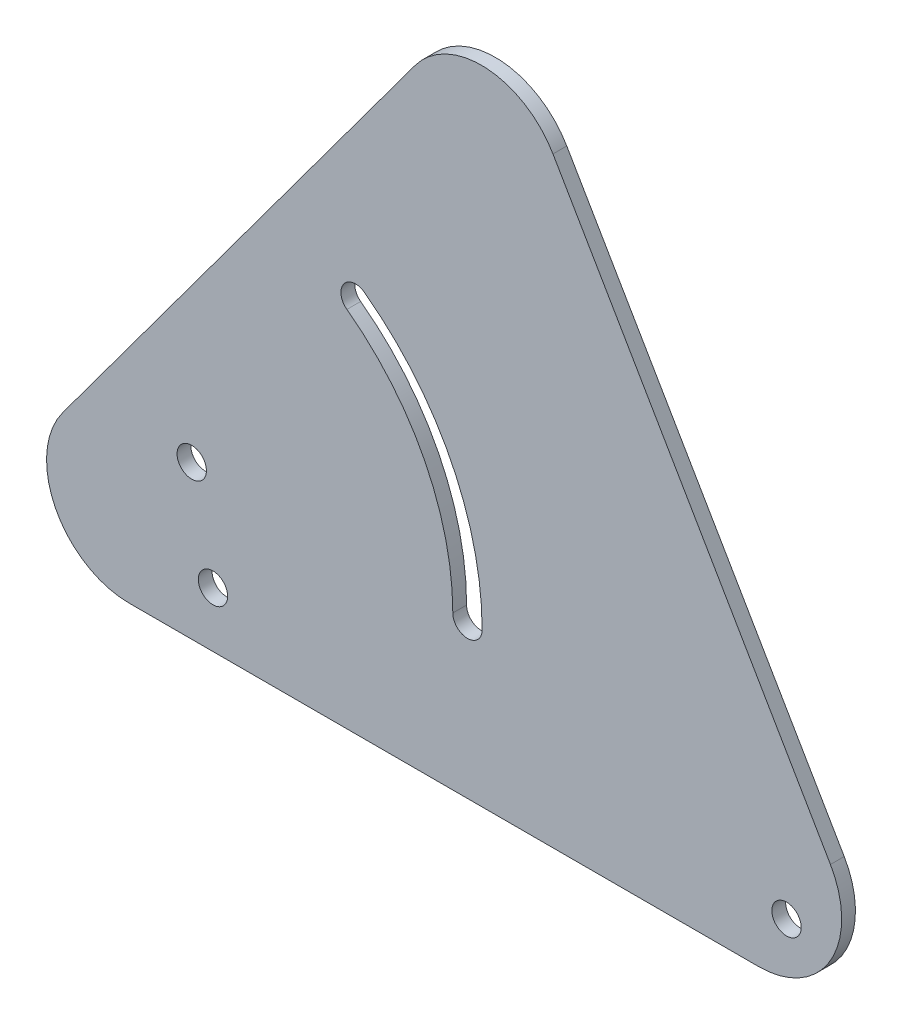
ISO-10303-21;
HEADER;
FILE_DESCRIPTION(('STEP AP214'),'2;1');
FILE_NAME('part.step','',(''),(''),'','','');
FILE_SCHEMA(('AUTOMOTIVE_DESIGN { 1 0 10303 214 1 1 1 1 }'));
ENDSEC;
DATA;
#1=APPLICATION_CONTEXT('core data for automotive mechanical design processes');
#2=APPLICATION_PROTOCOL_DEFINITION('international standard','automotive_design',2000,#1);
#3=PRODUCT_CONTEXT('',#1,'mechanical');
#4=PRODUCT('Part','Part','',(#3));
#5=PRODUCT_RELATED_PRODUCT_CATEGORY('part','',(#4));
#6=PRODUCT_DEFINITION_FORMATION('','',#4);
#7=PRODUCT_DEFINITION_CONTEXT('part definition',#1,'design');
#8=PRODUCT_DEFINITION('design','',#6,#7);
#9=PRODUCT_DEFINITION_SHAPE('','',#8);
#10=(LENGTH_UNIT() NAMED_UNIT(*) SI_UNIT(.MILLI.,.METRE.));
#11=(NAMED_UNIT(*) PLANE_ANGLE_UNIT() SI_UNIT($,.RADIAN.));
#12=(NAMED_UNIT(*) SI_UNIT($,.STERADIAN.) SOLID_ANGLE_UNIT());
#13=UNCERTAINTY_MEASURE_WITH_UNIT(LENGTH_MEASURE(1.E-05),#10,'distance_accuracy_value','');
#14=(GEOMETRIC_REPRESENTATION_CONTEXT(3) GLOBAL_UNCERTAINTY_ASSIGNED_CONTEXT((#13)) GLOBAL_UNIT_ASSIGNED_CONTEXT((#10,
#11,#12)) REPRESENTATION_CONTEXT('',''));
#15=CARTESIAN_POINT('',(0.,0.,0.));
#16=DIRECTION('',(0.,0.,1.));
#17=DIRECTION('',(1.,0.,0.));
#18=AXIS2_PLACEMENT_3D('',#15,#16,#17);
#19=CARTESIAN_POINT('',(37.7646327076216,19.05,-3.175));
#20=DIRECTION('',(0.,0.,1.));
#21=DIRECTION('',(1.,0.,0.));
#22=AXIS2_PLACEMENT_3D('',#19,#20,#21);
#23=CYLINDRICAL_SURFACE('',#22,19.05);
#24=CARTESIAN_POINT('',(37.7646327076216,19.05,0.));
#25=DIRECTION('',(0.,0.,1.));
#26=DIRECTION('',(-1.,0.,0.));
#27=AXIS2_PLACEMENT_3D('',#24,#25,#26);
#28=CIRCLE('',#27,19.05);
#29=CARTESIAN_POINT('',(22.4439580026019,30.3716353316545,0.));
#30=VERTEX_POINT('',#29);
#31=CARTESIAN_POINT('',(37.7646327076216,0.,0.));
#32=VERTEX_POINT('',#31);
#33=EDGE_CURVE('E171',#30,#32,#28,.T.);
#34=ORIENTED_EDGE('',*,*,#33,.F.);
#35=DIRECTION('',(0.,0.,1.));
#36=VECTOR('',#35,1.);
#37=CARTESIAN_POINT('',(22.4439580026019,30.3716353316545,-3.175));
#38=LINE('',#37,#36);
#39=CARTESIAN_POINT('',(22.4439580026019,30.3716353316545,-3.175));
#40=VERTEX_POINT('',#39);
#41=EDGE_CURVE('E11',#40,#30,#38,.T.);
#42=ORIENTED_EDGE('',*,*,#41,.F.);
#43=CARTESIAN_POINT('',(37.7646327076216,19.05,-3.175));
#44=DIRECTION('',(0.,0.,1.));
#45=DIRECTION('',(-1.,0.,0.));
#46=AXIS2_PLACEMENT_3D('',#43,#44,#45);
#47=CIRCLE('',#46,19.05);
#48=CARTESIAN_POINT('',(37.7646327076216,0.,-3.175));
#49=VERTEX_POINT('',#48);
#50=EDGE_CURVE('E152',#40,#49,#47,.T.);
#51=ORIENTED_EDGE('',*,*,#50,.T.);
#52=DIRECTION('',(0.,0.,1.));
#53=VECTOR('',#52,1.);
#54=CARTESIAN_POINT('',(37.7646327076216,0.,-3.175));
#55=LINE('',#54,#53);
#56=EDGE_CURVE('E38',#49,#32,#55,.T.);
#57=ORIENTED_EDGE('',*,*,#56,.T.);
#58=EDGE_LOOP('',(#34,#42,#51,#57));
#59=FACE_BOUND('',#58,.T.);
#60=ADVANCED_FACE('F35',(#59),#23,.T.);
#61=CARTESIAN_POINT('',(103.55134654623,140.127856906491,-3.175));
#62=DIRECTION('',(-0.804234892651955,0.594311565966117,0.));
#63=DIRECTION('',(-0.594311565966117,-0.804234892651955,0.));
#64=AXIS2_PLACEMENT_3D('',#61,#62,#63);
#65=PLANE('',#64);
#66=DIRECTION('',(-0.594311565966117,-0.804234892651955,0.));
#67=VECTOR('',#66,1.);
#68=CARTESIAN_POINT('',(103.55134654623,140.127856906491,0.));
#69=LINE('',#68,#67);
#70=CARTESIAN_POINT('',(103.55134654623,140.12785690649,0.));
#71=VERTEX_POINT('',#70);
#72=EDGE_CURVE('E156',#71,#30,#69,.T.);
#73=ORIENTED_EDGE('',*,*,#72,.F.);
#74=DIRECTION('',(0.,0.,1.));
#75=VECTOR('',#74,1.);
#76=CARTESIAN_POINT('',(103.55134654623,140.12785690649,-3.175));
#77=LINE('',#76,#75);
#78=CARTESIAN_POINT('',(103.55134654623,140.12785690649,-3.175));
#79=VERTEX_POINT('',#78);
#80=EDGE_CURVE('E43',#79,#71,#77,.T.);
#81=ORIENTED_EDGE('',*,*,#80,.F.);
#82=DIRECTION('',(-0.594311565966117,-0.804234892651955,0.));
#83=VECTOR('',#82,1.);
#84=CARTESIAN_POINT('',(103.55134654623,140.127856906491,-3.175));
#85=LINE('',#84,#83);
#86=EDGE_CURVE('E168',#79,#40,#85,.T.);
#87=ORIENTED_EDGE('',*,*,#86,.T.);
#88=ORIENTED_EDGE('',*,*,#41,.T.);
#89=EDGE_LOOP('',(#73,#81,#87,#88));
#90=FACE_BOUND('',#89,.T.);
#91=ADVANCED_FACE('F207',(#90),#65,.T.);
#92=CARTESIAN_POINT('',(118.872021251249,128.806221574836,-3.175));
#93=DIRECTION('',(0.,0.,1.));
#94=DIRECTION('',(1.,0.,0.));
#95=AXIS2_PLACEMENT_3D('',#92,#93,#94);
#96=CYLINDRICAL_SURFACE('',#95,19.05);
#97=CARTESIAN_POINT('',(118.872021251249,128.806221574836,0.));
#98=DIRECTION('',(0.,0.,1.));
#99=DIRECTION('',(1.,0.,0.));
#100=AXIS2_PLACEMENT_3D('',#97,#98,#99);
#101=CIRCLE('',#100,19.05);
#102=CARTESIAN_POINT('',(135.335454487475,138.390472514599,0.));
#103=VERTEX_POINT('',#102);
#104=EDGE_CURVE('E184',#103,#71,#101,.T.);
#105=ORIENTED_EDGE('',*,*,#104,.F.);
#106=DIRECTION('',(0.,0.,1.));
#107=VECTOR('',#106,1.);
#108=CARTESIAN_POINT('',(135.335454487475,138.390472514599,-3.175));
#109=LINE('',#108,#107);
#110=CARTESIAN_POINT('',(135.335454487475,138.390472514599,-3.175));
#111=VERTEX_POINT('',#110);
#112=EDGE_CURVE('E190',#111,#103,#109,.T.);
#113=ORIENTED_EDGE('',*,*,#112,.F.);
#114=CARTESIAN_POINT('',(118.872021251249,128.806221574836,-3.175));
#115=DIRECTION('',(0.,0.,1.));
#116=DIRECTION('',(1.,0.,0.));
#117=AXIS2_PLACEMENT_3D('',#114,#115,#116);
#118=CIRCLE('',#117,19.05);
#119=EDGE_CURVE('E165',#111,#79,#118,.T.);
#120=ORIENTED_EDGE('',*,*,#119,.T.);
#121=ORIENTED_EDGE('',*,*,#80,.T.);
#122=EDGE_LOOP('',(#105,#113,#120,#121));
#123=FACE_BOUND('',#122,.T.);
#124=ADVANCED_FACE('F218',(#123),#96,.T.);
#125=CARTESIAN_POINT('',(199.230460752562,28.6342509397631,-3.175));
#126=DIRECTION('',(0.864222217124692,0.503110285551867,0.));
#127=DIRECTION('',(-0.503110285551867,0.864222217124693,0.));
#128=AXIS2_PLACEMENT_3D('',#125,#126,#127);
#129=PLANE('',#128);
#130=DIRECTION('',(-0.503110285551867,0.864222217124693,0.));
#131=VECTOR('',#130,1.);
#132=CARTESIAN_POINT('',(199.230460752562,28.6342509397631,0.));
#133=LINE('',#132,#131);
#134=CARTESIAN_POINT('',(199.230460752562,28.6342509397631,0.));
#135=VERTEX_POINT('',#134);
#136=EDGE_CURVE('E181',#135,#103,#133,.T.);
#137=ORIENTED_EDGE('',*,*,#136,.F.);
#138=DIRECTION('',(0.,0.,1.));
#139=VECTOR('',#138,1.);
#140=CARTESIAN_POINT('',(199.230460752562,28.6342509397631,-3.175));
#141=LINE('',#140,#139);
#142=CARTESIAN_POINT('',(199.230460752562,28.6342509397631,-3.175));
#143=VERTEX_POINT('',#142);
#144=EDGE_CURVE('E192',#143,#135,#141,.T.);
#145=ORIENTED_EDGE('',*,*,#144,.F.);
#146=DIRECTION('',(-0.503110285551867,0.864222217124693,0.));
#147=VECTOR('',#146,1.);
#148=CARTESIAN_POINT('',(199.230460752562,28.6342509397631,-3.175));
#149=LINE('',#148,#147);
#150=EDGE_CURVE('E162',#143,#111,#149,.T.);
#151=ORIENTED_EDGE('',*,*,#150,.T.);
#152=ORIENTED_EDGE('',*,*,#112,.T.);
#153=EDGE_LOOP('',(#137,#145,#151,#152));
#154=FACE_BOUND('',#153,.T.);
#155=ADVANCED_FACE('F216',(#154),#129,.T.);
#156=CARTESIAN_POINT('',(182.767027516336,19.05,-3.175));
#157=DIRECTION('',(0.,0.,1.));
#158=DIRECTION('',(1.,0.,0.));
#159=AXIS2_PLACEMENT_3D('',#156,#157,#158);
#160=CYLINDRICAL_SURFACE('',#159,19.05);
#161=CARTESIAN_POINT('',(182.767027516336,19.05,0.));
#162=DIRECTION('',(0.,0.,1.));
#163=DIRECTION('',(1.,0.,0.));
#164=AXIS2_PLACEMENT_3D('',#161,#162,#163);
#165=CIRCLE('',#164,19.05);
#166=CARTESIAN_POINT('',(182.767027516336,0.,0.));
#167=VERTEX_POINT('',#166);
#168=EDGE_CURVE('E178',#167,#135,#165,.T.);
#169=ORIENTED_EDGE('',*,*,#168,.F.);
#170=DIRECTION('',(0.,0.,1.));
#171=VECTOR('',#170,1.);
#172=CARTESIAN_POINT('',(182.767027516336,0.,-3.175));
#173=LINE('',#172,#171);
#174=CARTESIAN_POINT('',(182.767027516336,0.,-3.175));
#175=VERTEX_POINT('',#174);
#176=EDGE_CURVE('E193',#175,#167,#173,.T.);
#177=ORIENTED_EDGE('',*,*,#176,.F.);
#178=CARTESIAN_POINT('',(182.767027516336,19.05,-3.175));
#179=DIRECTION('',(0.,0.,1.));
#180=DIRECTION('',(1.,0.,0.));
#181=AXIS2_PLACEMENT_3D('',#178,#179,#180);
#182=CIRCLE('',#181,19.05);
#183=EDGE_CURVE('E159',#175,#143,#182,.T.);
#184=ORIENTED_EDGE('',*,*,#183,.T.);
#185=ORIENTED_EDGE('',*,*,#144,.T.);
#186=EDGE_LOOP('',(#169,#177,#184,#185));
#187=FACE_BOUND('',#186,.T.);
#188=ADVANCED_FACE('F213',(#187),#160,.T.);
#189=CARTESIAN_POINT('',(37.7646327076216,0.,-3.175));
#190=DIRECTION('',(0.,-1.,0.));
#191=DIRECTION('',(0.,0.,-1.));
#192=AXIS2_PLACEMENT_3D('',#189,#190,#191);
#193=PLANE('',#192);
#194=DIRECTION('',(1.,0.,0.));
#195=VECTOR('',#194,1.);
#196=CARTESIAN_POINT('',(37.7646327076216,0.,0.));
#197=LINE('',#196,#195);
#198=EDGE_CURVE('E174',#32,#167,#197,.T.);
#199=ORIENTED_EDGE('',*,*,#198,.F.);
#200=ORIENTED_EDGE('',*,*,#56,.F.);
#201=DIRECTION('',(1.,0.,0.));
#202=VECTOR('',#201,1.);
#203=CARTESIAN_POINT('',(37.7646327076216,0.,-3.175));
#204=LINE('',#203,#202);
#205=EDGE_CURVE('E155',#49,#175,#204,.T.);
#206=ORIENTED_EDGE('',*,*,#205,.T.);
#207=ORIENTED_EDGE('',*,*,#176,.T.);
#208=EDGE_LOOP('',(#199,#200,#206,#207));
#209=FACE_BOUND('',#208,.T.);
#210=ADVANCED_FACE('F201',(#209),#193,.T.);
#211=CARTESIAN_POINT('',(37.7646327076216,19.05,-3.175));
#212=DIRECTION('',(0.,0.,-1.));
#213=DIRECTION('',(-1.,0.,0.));
#214=AXIS2_PLACEMENT_3D('',#211,#212,#213);
#215=PLANE('',#214);
#216=CARTESIAN_POINT('',(57.0370275163365,12.7,-3.175));
#217=DIRECTION('',(0.,0.,1.));
#218=DIRECTION('',(1.,0.,0.));
#219=AXIS2_PLACEMENT_3D('',#216,#217,#218);
#220=CIRCLE('',#219,3.37819999999999);
#221=CARTESIAN_POINT('',(60.4152275163365,12.7,-3.175));
#222=VERTEX_POINT('',#221);
#223=EDGE_CURVE('E143',#222,#222,#220,.T.);
#224=ORIENTED_EDGE('',*,*,#223,.T.);
#225=EDGE_LOOP('',(#224));
#226=FACE_BOUND('',#225,.T.);
#227=CARTESIAN_POINT('',(189.117027516336,12.7,-3.175));
#228=DIRECTION('',(0.,0.,1.));
#229=DIRECTION('',(1.,0.,0.));
#230=AXIS2_PLACEMENT_3D('',#227,#228,#229);
#231=CIRCLE('',#230,3.37819999999999);
#232=CARTESIAN_POINT('',(192.495227516336,12.7,-3.175));
#233=VERTEX_POINT('',#232);
#234=EDGE_CURVE('E384',#233,#233,#231,.T.);
#235=ORIENTED_EDGE('',*,*,#234,.T.);
#236=EDGE_LOOP('',(#235));
#237=FACE_BOUND('',#236,.T.);
#238=CARTESIAN_POINT('',(52.1461634295803,35.306,-3.175));
#239=DIRECTION('',(0.,0.,1.));
#240=DIRECTION('',(1.,0.,0.));
#241=AXIS2_PLACEMENT_3D('',#238,#239,#240);
#242=CIRCLE('',#241,3.37819999999999);
#243=CARTESIAN_POINT('',(55.5243634295802,35.306,-3.175));
#244=VERTEX_POINT('',#243);
#245=EDGE_CURVE('E175',#244,#244,#242,.T.);
#246=ORIENTED_EDGE('',*,*,#245,.T.);
#247=EDGE_LOOP('',(#246));
#248=FACE_BOUND('',#247,.T.);
#249=CARTESIAN_POINT('',(115.64616342958,35.306,-3.175));
#250=DIRECTION('',(0.,0.,1.));
#251=DIRECTION('',(1.,0.,0.));
#252=AXIS2_PLACEMENT_3D('',#249,#250,#251);
#253=CIRCLE('',#252,3.3782);
#254=CARTESIAN_POINT('',(112.26796342958,35.306,-3.175));
#255=VERTEX_POINT('',#254);
#256=CARTESIAN_POINT('',(119.02436342958,35.306,-3.175));
#257=VERTEX_POINT('',#256);
#258=EDGE_CURVE('E114',#255,#257,#253,.T.);
#259=ORIENTED_EDGE('',*,*,#258,.T.);
#260=CARTESIAN_POINT('',(52.1461634295803,35.306,-3.175));
#261=DIRECTION('',(0.,0.,1.));
#262=DIRECTION('',(1.,0.,0.));
#263=AXIS2_PLACEMENT_3D('',#260,#261,#262);
#264=CIRCLE('',#263,66.8782);
#265=CARTESIAN_POINT('',(91.8926512005754,89.091781997756,-3.175));
#266=VERTEX_POINT('',#265);
#267=EDGE_CURVE('E123',#257,#266,#264,.T.);
#268=ORIENTED_EDGE('',*,*,#267,.T.);
#269=CARTESIAN_POINT('',(89.8849478684287,86.3749156833991,-3.175));
#270=DIRECTION('',(0.,0.,1.));
#271=DIRECTION('',(1.,0.,0.));
#272=AXIS2_PLACEMENT_3D('',#269,#270,#271);
#273=CIRCLE('',#272,3.37819999999999);
#274=CARTESIAN_POINT('',(87.877244536282,83.6580493690423,-3.175));
#275=VERTEX_POINT('',#274);
#276=EDGE_CURVE('E51',#266,#275,#273,.T.);
#277=ORIENTED_EDGE('',*,*,#276,.T.);
#278=CARTESIAN_POINT('',(52.1461634295803,35.306,-3.175));
#279=DIRECTION('',(0.,0.,-1.));
#280=DIRECTION('',(1.,0.,0.));
#281=AXIS2_PLACEMENT_3D('',#278,#279,#280);
#282=CIRCLE('',#281,60.1218);
#283=EDGE_CURVE('E120',#275,#255,#282,.T.);
#284=ORIENTED_EDGE('',*,*,#283,.T.);
#285=EDGE_LOOP('',(#259,#268,#277,#284));
#286=FACE_BOUND('',#285,.T.);
#287=ORIENTED_EDGE('',*,*,#50,.F.);
#288=ORIENTED_EDGE('',*,*,#86,.F.);
#289=ORIENTED_EDGE('',*,*,#119,.F.);
#290=ORIENTED_EDGE('',*,*,#150,.F.);
#291=ORIENTED_EDGE('',*,*,#183,.F.);
#292=ORIENTED_EDGE('',*,*,#205,.F.);
#293=EDGE_LOOP('',(#287,#288,#289,#290,#291,#292));
#294=FACE_BOUND('',#293,.T.);
#295=ADVANCED_FACE('F127',(#226,#237,#248,#286,#294),#215,.T.);
#296=CARTESIAN_POINT('',(37.7646327076216,19.05,0.));
#297=DIRECTION('',(0.,0.,-1.));
#298=DIRECTION('',(-1.,0.,0.));
#299=AXIS2_PLACEMENT_3D('',#296,#297,#298);
#300=PLANE('',#299);
#301=CARTESIAN_POINT('',(57.0370275163365,12.7,0.));
#302=DIRECTION('',(0.,0.,1.));
#303=DIRECTION('',(1.,0.,0.));
#304=AXIS2_PLACEMENT_3D('',#301,#302,#303);
#305=CIRCLE('',#304,3.37819999999999);
#306=CARTESIAN_POINT('',(60.4152275163365,12.7,0.));
#307=VERTEX_POINT('',#306);
#308=EDGE_CURVE('E383',#307,#307,#305,.T.);
#309=ORIENTED_EDGE('',*,*,#308,.F.);
#310=EDGE_LOOP('',(#309));
#311=FACE_BOUND('',#310,.T.);
#312=CARTESIAN_POINT('',(189.117027516336,12.7,0.));
#313=DIRECTION('',(0.,0.,1.));
#314=DIRECTION('',(1.,0.,0.));
#315=AXIS2_PLACEMENT_3D('',#312,#313,#314);
#316=CIRCLE('',#315,3.37819999999999);
#317=CARTESIAN_POINT('',(192.495227516336,12.7,0.));
#318=VERTEX_POINT('',#317);
#319=EDGE_CURVE('E388',#318,#318,#316,.T.);
#320=ORIENTED_EDGE('',*,*,#319,.F.);
#321=EDGE_LOOP('',(#320));
#322=FACE_BOUND('',#321,.T.);
#323=CARTESIAN_POINT('',(52.1461634295803,35.306,0.));
#324=DIRECTION('',(0.,0.,1.));
#325=DIRECTION('',(1.,0.,0.));
#326=AXIS2_PLACEMENT_3D('',#323,#324,#325);
#327=CIRCLE('',#326,3.37819999999999);
#328=CARTESIAN_POINT('',(55.5243634295802,35.306,0.));
#329=VERTEX_POINT('',#328);
#330=EDGE_CURVE('E136',#329,#329,#327,.T.);
#331=ORIENTED_EDGE('',*,*,#330,.F.);
#332=EDGE_LOOP('',(#331));
#333=FACE_BOUND('',#332,.T.);
#334=CARTESIAN_POINT('',(52.1461634295803,35.306,0.));
#335=DIRECTION('',(0.,0.,1.));
#336=DIRECTION('',(1.,0.,0.));
#337=AXIS2_PLACEMENT_3D('',#334,#335,#336);
#338=CIRCLE('',#337,66.8782);
#339=CARTESIAN_POINT('',(119.02436342958,35.306,0.));
#340=VERTEX_POINT('',#339);
#341=CARTESIAN_POINT('',(91.8926512005754,89.091781997756,0.));
#342=VERTEX_POINT('',#341);
#343=EDGE_CURVE('E142',#340,#342,#338,.T.);
#344=ORIENTED_EDGE('',*,*,#343,.F.);
#345=CARTESIAN_POINT('',(115.64616342958,35.306,0.));
#346=DIRECTION('',(0.,0.,1.));
#347=DIRECTION('',(1.,0.,0.));
#348=AXIS2_PLACEMENT_3D('',#345,#346,#347);
#349=CIRCLE('',#348,3.3782);
#350=CARTESIAN_POINT('',(112.26796342958,35.306,0.));
#351=VERTEX_POINT('',#350);
#352=EDGE_CURVE('E59',#351,#340,#349,.T.);
#353=ORIENTED_EDGE('',*,*,#352,.F.);
#354=CARTESIAN_POINT('',(52.1461634295803,35.306,0.));
#355=DIRECTION('',(0.,0.,-1.));
#356=DIRECTION('',(1.,0.,0.));
#357=AXIS2_PLACEMENT_3D('',#354,#355,#356);
#358=CIRCLE('',#357,60.1218);
#359=CARTESIAN_POINT('',(87.877244536282,83.6580493690423,0.));
#360=VERTEX_POINT('',#359);
#361=EDGE_CURVE('E130',#360,#351,#358,.T.);
#362=ORIENTED_EDGE('',*,*,#361,.F.);
#363=CARTESIAN_POINT('',(89.8849478684287,86.3749156833991,0.));
#364=DIRECTION('',(0.,0.,1.));
#365=DIRECTION('',(1.,0.,0.));
#366=AXIS2_PLACEMENT_3D('',#363,#364,#365);
#367=CIRCLE('',#366,3.37819999999999);
#368=EDGE_CURVE('E133',#342,#360,#367,.T.);
#369=ORIENTED_EDGE('',*,*,#368,.F.);
#370=EDGE_LOOP('',(#344,#353,#362,#369));
#371=FACE_BOUND('',#370,.T.);
#372=ORIENTED_EDGE('',*,*,#33,.T.);
#373=ORIENTED_EDGE('',*,*,#198,.T.);
#374=ORIENTED_EDGE('',*,*,#168,.T.);
#375=ORIENTED_EDGE('',*,*,#136,.T.);
#376=ORIENTED_EDGE('',*,*,#104,.T.);
#377=ORIENTED_EDGE('',*,*,#72,.T.);
#378=EDGE_LOOP('',(#372,#373,#374,#375,#376,#377));
#379=FACE_BOUND('',#378,.T.);
#380=ADVANCED_FACE('F203',(#311,#322,#333,#371,#379),#300,.F.);
#381=CARTESIAN_POINT('',(115.64616342958,35.306,-3.175));
#382=DIRECTION('',(0.,0.,1.));
#383=DIRECTION('',(1.,0.,0.));
#384=AXIS2_PLACEMENT_3D('',#381,#382,#383);
#385=CYLINDRICAL_SURFACE('',#384,3.3782);
#386=ORIENTED_EDGE('',*,*,#352,.T.);
#387=DIRECTION('',(0.,0.,1.));
#388=VECTOR('',#387,1.);
#389=CARTESIAN_POINT('',(119.02436342958,35.306,-3.175));
#390=LINE('',#389,#388);
#391=EDGE_CURVE('E110',#257,#340,#390,.T.);
#392=ORIENTED_EDGE('',*,*,#391,.F.);
#393=ORIENTED_EDGE('',*,*,#258,.F.);
#394=DIRECTION('',(0.,0.,1.));
#395=VECTOR('',#394,1.);
#396=CARTESIAN_POINT('',(112.26796342958,35.306,-3.175));
#397=LINE('',#396,#395);
#398=EDGE_CURVE('E147',#255,#351,#397,.T.);
#399=ORIENTED_EDGE('',*,*,#398,.T.);
#400=EDGE_LOOP('',(#386,#392,#393,#399));
#401=FACE_BOUND('',#400,.T.);
#402=ADVANCED_FACE('F112',(#401),#385,.F.);
#403=CARTESIAN_POINT('',(52.1461634295803,35.306,-3.175));
#404=DIRECTION('',(0.,0.,1.));
#405=DIRECTION('',(1.,0.,0.));
#406=AXIS2_PLACEMENT_3D('',#403,#404,#405);
#407=CYLINDRICAL_SURFACE('',#406,60.1218);
#408=ORIENTED_EDGE('',*,*,#361,.T.);
#409=ORIENTED_EDGE('',*,*,#398,.F.);
#410=ORIENTED_EDGE('',*,*,#283,.F.);
#411=DIRECTION('',(0.,0.,1.));
#412=VECTOR('',#411,1.);
#413=CARTESIAN_POINT('',(87.877244536282,83.6580493690423,-3.175));
#414=LINE('',#413,#412);
#415=EDGE_CURVE('E149',#275,#360,#414,.T.);
#416=ORIENTED_EDGE('',*,*,#415,.T.);
#417=EDGE_LOOP('',(#408,#409,#410,#416));
#418=FACE_BOUND('',#417,.T.);
#419=ADVANCED_FACE('F275',(#418),#407,.T.);
#420=CARTESIAN_POINT('',(89.8849478684287,86.3749156833991,-3.175));
#421=DIRECTION('',(0.,0.,1.));
#422=DIRECTION('',(1.,0.,0.));
#423=AXIS2_PLACEMENT_3D('',#420,#421,#422);
#424=CYLINDRICAL_SURFACE('',#423,3.37819999999999);
#425=ORIENTED_EDGE('',*,*,#368,.T.);
#426=ORIENTED_EDGE('',*,*,#415,.F.);
#427=ORIENTED_EDGE('',*,*,#276,.F.);
#428=DIRECTION('',(0.,0.,1.));
#429=VECTOR('',#428,1.);
#430=CARTESIAN_POINT('',(91.8926512005754,89.091781997756,-3.175));
#431=LINE('',#430,#429);
#432=EDGE_CURVE('E119',#266,#342,#431,.T.);
#433=ORIENTED_EDGE('',*,*,#432,.T.);
#434=EDGE_LOOP('',(#425,#426,#427,#433));
#435=FACE_BOUND('',#434,.T.);
#436=ADVANCED_FACE('F287',(#435),#424,.F.);
#437=CARTESIAN_POINT('',(52.1461634295803,35.306,-3.175));
#438=DIRECTION('',(0.,0.,1.));
#439=DIRECTION('',(1.,0.,0.));
#440=AXIS2_PLACEMENT_3D('',#437,#438,#439);
#441=CYLINDRICAL_SURFACE('',#440,66.8782);
#442=ORIENTED_EDGE('',*,*,#343,.T.);
#443=ORIENTED_EDGE('',*,*,#432,.F.);
#444=ORIENTED_EDGE('',*,*,#267,.F.);
#445=ORIENTED_EDGE('',*,*,#391,.T.);
#446=EDGE_LOOP('',(#442,#443,#444,#445));
#447=FACE_BOUND('',#446,.T.);
#448=ADVANCED_FACE('F124',(#447),#441,.F.);
#449=CARTESIAN_POINT('',(52.1461634295803,35.306,-3.175));
#450=DIRECTION('',(0.,0.,1.));
#451=DIRECTION('',(1.,0.,0.));
#452=AXIS2_PLACEMENT_3D('',#449,#450,#451);
#453=CYLINDRICAL_SURFACE('',#452,3.37819999999999);
#454=ORIENTED_EDGE('',*,*,#245,.F.);
#455=EDGE_LOOP('',(#454));
#456=FACE_BOUND('',#455,.T.);
#457=ORIENTED_EDGE('',*,*,#330,.T.);
#458=EDGE_LOOP('',(#457));
#459=FACE_BOUND('',#458,.T.);
#460=ADVANCED_FACE('F307',(#456,#459),#453,.F.);
#461=CARTESIAN_POINT('',(189.117027516336,12.7,-3.175));
#462=DIRECTION('',(0.,0.,1.));
#463=DIRECTION('',(1.,0.,0.));
#464=AXIS2_PLACEMENT_3D('',#461,#462,#463);
#465=CYLINDRICAL_SURFACE('',#464,3.37819999999999);
#466=ORIENTED_EDGE('',*,*,#234,.F.);
#467=EDGE_LOOP('',(#466));
#468=FACE_BOUND('',#467,.T.);
#469=ORIENTED_EDGE('',*,*,#319,.T.);
#470=EDGE_LOOP('',(#469));
#471=FACE_BOUND('',#470,.T.);
#472=ADVANCED_FACE('F317',(#468,#471),#465,.F.);
#473=CARTESIAN_POINT('',(57.0370275163365,12.7,-3.175));
#474=DIRECTION('',(0.,0.,1.));
#475=DIRECTION('',(1.,0.,0.));
#476=AXIS2_PLACEMENT_3D('',#473,#474,#475);
#477=CYLINDRICAL_SURFACE('',#476,3.37819999999999);
#478=ORIENTED_EDGE('',*,*,#223,.F.);
#479=EDGE_LOOP('',(#478));
#480=FACE_BOUND('',#479,.T.);
#481=ORIENTED_EDGE('',*,*,#308,.T.);
#482=EDGE_LOOP('',(#481));
#483=FACE_BOUND('',#482,.T.);
#484=ADVANCED_FACE('F344',(#480,#483),#477,.F.);
#485=CLOSED_SHELL('',(#60,#91,#124,#155,#188,#210,#295,#380,#402,#419,#436,#448,#460,#472,#484));
#486=MANIFOLD_SOLID_BREP('B2',#485);
#487=ADVANCED_BREP_SHAPE_REPRESENTATION('',(#18,#486),#14);
#488=SHAPE_DEFINITION_REPRESENTATION(#9,#487);
ENDSEC;
END-ISO-10303-21;
